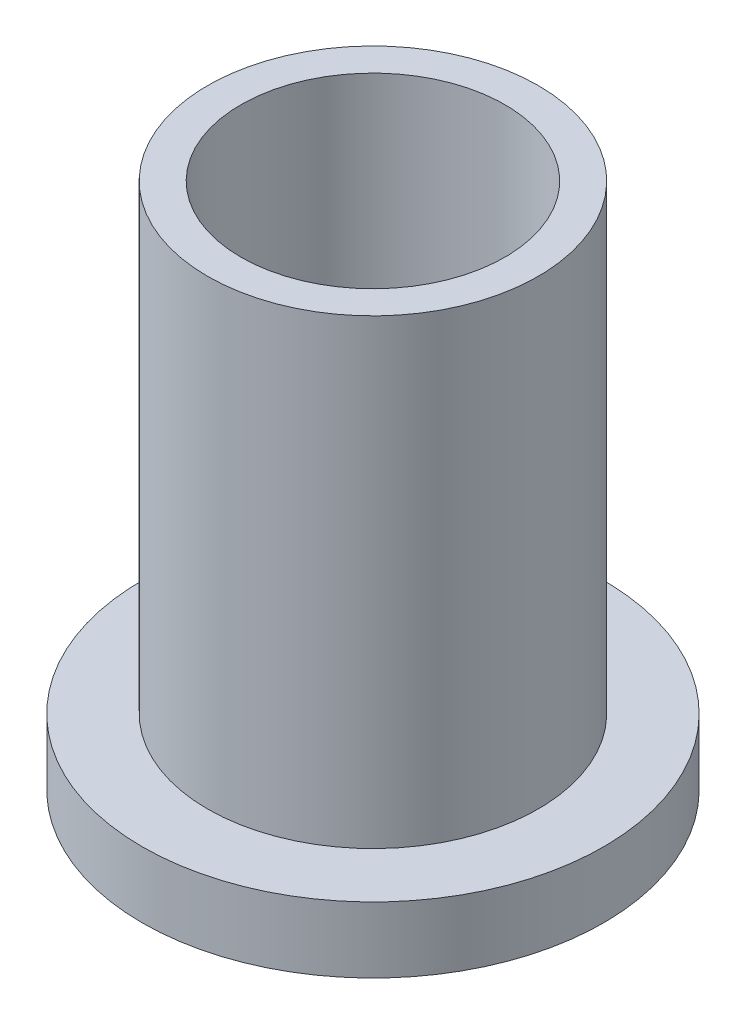
ISO-10303-21;
HEADER;
FILE_DESCRIPTION(('STEP AP214'),'2;1');
FILE_NAME('part.step','',(''),(''),'','','');
FILE_SCHEMA(('AUTOMOTIVE_DESIGN { 1 0 10303 214 1 1 1 1 }'));
ENDSEC;
DATA;
#1=APPLICATION_CONTEXT('core data for automotive mechanical design processes');
#2=APPLICATION_PROTOCOL_DEFINITION('international standard','automotive_design',2000,#1);
#3=PRODUCT_CONTEXT('',#1,'mechanical');
#4=PRODUCT('Part','Part','',(#3));
#5=PRODUCT_RELATED_PRODUCT_CATEGORY('part','',(#4));
#6=PRODUCT_DEFINITION_FORMATION('','',#4);
#7=PRODUCT_DEFINITION_CONTEXT('part definition',#1,'design');
#8=PRODUCT_DEFINITION('design','',#6,#7);
#9=PRODUCT_DEFINITION_SHAPE('','',#8);
#10=(LENGTH_UNIT() NAMED_UNIT(*) SI_UNIT(.MILLI.,.METRE.));
#11=(NAMED_UNIT(*) PLANE_ANGLE_UNIT() SI_UNIT($,.RADIAN.));
#12=(NAMED_UNIT(*) SI_UNIT($,.STERADIAN.) SOLID_ANGLE_UNIT());
#13=UNCERTAINTY_MEASURE_WITH_UNIT(LENGTH_MEASURE(1.E-05),#10,'distance_accuracy_value','');
#14=(GEOMETRIC_REPRESENTATION_CONTEXT(3) GLOBAL_UNCERTAINTY_ASSIGNED_CONTEXT((#13)) GLOBAL_UNIT_ASSIGNED_CONTEXT((#10,
#11,#12)) REPRESENTATION_CONTEXT('',''));
#15=CARTESIAN_POINT('',(0.,0.,0.));
#16=DIRECTION('',(0.,0.,1.));
#17=DIRECTION('',(1.,0.,0.));
#18=AXIS2_PLACEMENT_3D('',#15,#16,#17);
#19=CARTESIAN_POINT('',(0.,25.4,0.));
#20=DIRECTION('',(0.,1.,0.));
#21=DIRECTION('',(0.,0.,1.));
#22=AXIS2_PLACEMENT_3D('',#19,#20,#21);
#23=PLANE('',#22);
#24=CARTESIAN_POINT('',(0.,25.4,0.));
#25=DIRECTION('',(0.,1.,0.));
#26=DIRECTION('',(0.,0.,1.));
#27=AXIS2_PLACEMENT_3D('',#24,#25,#26);
#28=CIRCLE('',#27,7.9629);
#29=CARTESIAN_POINT('',(0.,25.4,7.9629));
#30=VERTEX_POINT('',#29);
#31=EDGE_CURVE('E10',#30,#30,#28,.T.);
#32=ORIENTED_EDGE('',*,*,#31,.T.);
#33=EDGE_LOOP('',(#32));
#34=FACE_BOUND('',#33,.T.);
#35=CARTESIAN_POINT('',(0.,25.4,0.));
#36=DIRECTION('',(0.,1.,0.));
#37=DIRECTION('',(0.,0.,1.));
#38=AXIS2_PLACEMENT_3D('',#35,#36,#37);
#39=CIRCLE('',#38,6.3627);
#40=CARTESIAN_POINT('',(0.,25.4,6.3627));
#41=VERTEX_POINT('',#40);
#42=EDGE_CURVE('E38',#41,#41,#39,.T.);
#43=ORIENTED_EDGE('',*,*,#42,.F.);
#44=EDGE_LOOP('',(#43));
#45=FACE_BOUND('',#44,.T.);
#46=ADVANCED_FACE('F31',(#34,#45),#23,.T.);
#47=CARTESIAN_POINT('',(0.,0.,0.));
#48=DIRECTION('',(0.,1.,0.));
#49=DIRECTION('',(0.,0.,1.));
#50=AXIS2_PLACEMENT_3D('',#47,#48,#49);
#51=PLANE('',#50);
#52=CARTESIAN_POINT('',(0.,0.,0.));
#53=DIRECTION('',(0.,1.,0.));
#54=DIRECTION('',(0.,0.,1.));
#55=AXIS2_PLACEMENT_3D('',#52,#53,#54);
#56=CIRCLE('',#55,6.3627);
#57=CARTESIAN_POINT('',(0.,0.,6.3627));
#58=VERTEX_POINT('',#57);
#59=EDGE_CURVE('E42',#58,#58,#56,.T.);
#60=ORIENTED_EDGE('',*,*,#59,.T.);
#61=EDGE_LOOP('',(#60));
#62=FACE_BOUND('',#61,.T.);
#63=CARTESIAN_POINT('',(0.,0.,0.));
#64=DIRECTION('',(0.,1.,0.));
#65=DIRECTION('',(0.,0.,1.));
#66=AXIS2_PLACEMENT_3D('',#63,#64,#65);
#67=CIRCLE('',#66,11.1125);
#68=CARTESIAN_POINT('',(0.,0.,11.1125));
#69=VERTEX_POINT('',#68);
#70=EDGE_CURVE('E49',#69,#69,#67,.T.);
#71=ORIENTED_EDGE('',*,*,#70,.F.);
#72=EDGE_LOOP('',(#71));
#73=FACE_BOUND('',#72,.T.);
#74=ADVANCED_FACE('F74',(#62,#73),#51,.F.);
#75=CARTESIAN_POINT('',(0.,25.4,0.));
#76=DIRECTION('',(0.,-1.,0.));
#77=DIRECTION('',(0.,0.,-1.));
#78=AXIS2_PLACEMENT_3D('',#75,#76,#77);
#79=CYLINDRICAL_SURFACE('',#78,7.9629);
#80=CARTESIAN_POINT('',(0.,3.175,0.));
#81=DIRECTION('',(0.,1.,0.));
#82=DIRECTION('',(0.,0.,1.));
#83=AXIS2_PLACEMENT_3D('',#80,#81,#82);
#84=CIRCLE('',#83,7.9629);
#85=CARTESIAN_POINT('',(0.,3.175,7.9629));
#86=VERTEX_POINT('',#85);
#87=EDGE_CURVE('E52',#86,#86,#84,.T.);
#88=ORIENTED_EDGE('',*,*,#87,.T.);
#89=EDGE_LOOP('',(#88));
#90=FACE_BOUND('',#89,.T.);
#91=ORIENTED_EDGE('',*,*,#31,.F.);
#92=EDGE_LOOP('',(#91));
#93=FACE_BOUND('',#92,.T.);
#94=ADVANCED_FACE('F33',(#90,#93),#79,.T.);
#95=CARTESIAN_POINT('',(0.,25.4,0.));
#96=DIRECTION('',(0.,-1.,0.));
#97=DIRECTION('',(0.,0.,-1.));
#98=AXIS2_PLACEMENT_3D('',#95,#96,#97);
#99=CYLINDRICAL_SURFACE('',#98,6.3627);
#100=ORIENTED_EDGE('',*,*,#42,.T.);
#101=EDGE_LOOP('',(#100));
#102=FACE_BOUND('',#101,.T.);
#103=ORIENTED_EDGE('',*,*,#59,.F.);
#104=EDGE_LOOP('',(#103));
#105=FACE_BOUND('',#104,.T.);
#106=ADVANCED_FACE('F63',(#102,#105),#99,.F.);
#107=CARTESIAN_POINT('',(0.,3.175,0.));
#108=DIRECTION('',(0.,1.,0.));
#109=DIRECTION('',(0.,0.,1.));
#110=AXIS2_PLACEMENT_3D('',#107,#108,#109);
#111=PLANE('',#110);
#112=CARTESIAN_POINT('',(0.,3.175,0.));
#113=DIRECTION('',(0.,1.,0.));
#114=DIRECTION('',(0.,0.,1.));
#115=AXIS2_PLACEMENT_3D('',#112,#113,#114);
#116=CIRCLE('',#115,11.1125);
#117=CARTESIAN_POINT('',(0.,3.175,11.1125));
#118=VERTEX_POINT('',#117);
#119=EDGE_CURVE('E47',#118,#118,#116,.T.);
#120=ORIENTED_EDGE('',*,*,#119,.T.);
#121=EDGE_LOOP('',(#120));
#122=FACE_BOUND('',#121,.T.);
#123=ORIENTED_EDGE('',*,*,#87,.F.);
#124=EDGE_LOOP('',(#123));
#125=FACE_BOUND('',#124,.T.);
#126=ADVANCED_FACE('F60',(#122,#125),#111,.T.);
#127=CARTESIAN_POINT('',(0.,3.175,0.));
#128=DIRECTION('',(0.,-1.,0.));
#129=DIRECTION('',(0.,0.,-1.));
#130=AXIS2_PLACEMENT_3D('',#127,#128,#129);
#131=CYLINDRICAL_SURFACE('',#130,11.1125);
#132=ORIENTED_EDGE('',*,*,#119,.F.);
#133=EDGE_LOOP('',(#132));
#134=FACE_BOUND('',#133,.T.);
#135=ORIENTED_EDGE('',*,*,#70,.T.);
#136=EDGE_LOOP('',(#135));
#137=FACE_BOUND('',#136,.T.);
#138=ADVANCED_FACE('F62',(#134,#137),#131,.T.);
#139=CLOSED_SHELL('',(#46,#74,#94,#106,#126,#138));
#140=MANIFOLD_SOLID_BREP('B2',#139);
#141=ADVANCED_BREP_SHAPE_REPRESENTATION('',(#18,#140),#14);
#142=SHAPE_DEFINITION_REPRESENTATION(#9,#141);
ENDSEC;
END-ISO-10303-21;
